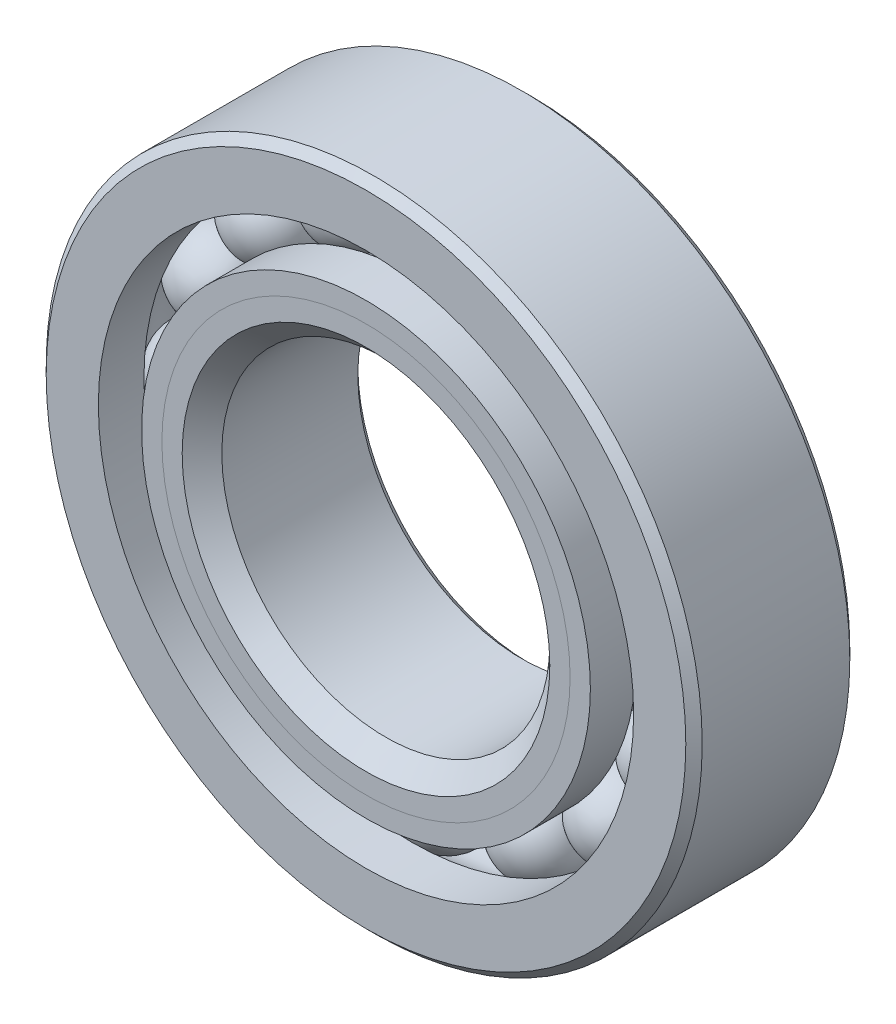
ISO-10303-21;
HEADER;
FILE_DESCRIPTION(('STEP AP214'),'2;1');
FILE_NAME('part.step','',(''),(''),'','','');
FILE_SCHEMA(('AUTOMOTIVE_DESIGN { 1 0 10303 214 1 1 1 1 }'));
ENDSEC;
DATA;
#1=APPLICATION_CONTEXT('core data for automotive mechanical design processes');
#2=APPLICATION_PROTOCOL_DEFINITION('international standard','automotive_design',2000,#1);
#3=PRODUCT_CONTEXT('',#1,'mechanical');
#4=PRODUCT('Part','Part','',(#3));
#5=PRODUCT_RELATED_PRODUCT_CATEGORY('part','',(#4));
#6=PRODUCT_DEFINITION_FORMATION('','',#4);
#7=PRODUCT_DEFINITION_CONTEXT('part definition',#1,'design');
#8=PRODUCT_DEFINITION('design','',#6,#7);
#9=PRODUCT_DEFINITION_SHAPE('','',#8);
#10=(LENGTH_UNIT() NAMED_UNIT(*) SI_UNIT(.MILLI.,.METRE.));
#11=(NAMED_UNIT(*) PLANE_ANGLE_UNIT() SI_UNIT($,.RADIAN.));
#12=(NAMED_UNIT(*) SI_UNIT($,.STERADIAN.) SOLID_ANGLE_UNIT());
#13=UNCERTAINTY_MEASURE_WITH_UNIT(LENGTH_MEASURE(1.E-05),#10,'distance_accuracy_value','');
#14=(GEOMETRIC_REPRESENTATION_CONTEXT(3) GLOBAL_UNCERTAINTY_ASSIGNED_CONTEXT((#13)) GLOBAL_UNIT_ASSIGNED_CONTEXT((#10,
#11,#12)) REPRESENTATION_CONTEXT('',''));
#15=CARTESIAN_POINT('',(0.,0.,0.));
#16=DIRECTION('',(0.,0.,1.));
#17=DIRECTION('',(1.,0.,0.));
#18=AXIS2_PLACEMENT_3D('',#15,#16,#17);
#19=CARTESIAN_POINT('',(-1.82252984663868,4.39997627358503,0.));
#20=DIRECTION('',(0.,0.,1.));
#21=DIRECTION('',(-0.382683432365077,0.923879532511292,0.));
#22=AXIS2_PLACEMENT_3D('',#19,#20,#21);
#23=SPHERICAL_SURFACE('',#22,0.820428356767388);
#24=CARTESIAN_POINT('',(-1.82252984663868,4.39997627358503,0.820428356767387));
#25=VERTEX_POINT('',#24);
#26=VERTEX_LOOP('',#25);
#27=FACE_BOUND('',#26,.T.);
#28=ADVANCED_FACE('F37',(#27),#23,.T.);
#29=CLOSED_SHELL('',(#28));
#30=MANIFOLD_SOLID_BREP('B2',#29);
#31=CARTESIAN_POINT('',(-3.36759604540089,3.36759604540097,0.));
#32=DIRECTION('',(0.,0.,1.));
#33=DIRECTION('',(-0.707106781186539,0.707106781186556,0.));
#34=AXIS2_PLACEMENT_3D('',#31,#32,#33);
#35=SPHERICAL_SURFACE('',#34,0.820428356767388);
#36=CARTESIAN_POINT('',(-3.36759604540089,3.36759604540097,0.820428356767387));
#37=VERTEX_POINT('',#36);
#38=VERTEX_LOOP('',#37);
#39=FACE_BOUND('',#38,.T.);
#40=ADVANCED_FACE('F57',(#39),#35,.T.);
#41=CLOSED_SHELL('',(#40));
#42=MANIFOLD_SOLID_BREP('B6',#41);
#43=CARTESIAN_POINT('',(-4.39997627358498,1.82252984663879,0.));
#44=DIRECTION('',(0.,0.,1.));
#45=DIRECTION('',(-0.923879532511283,0.3826834323651,0.));
#46=AXIS2_PLACEMENT_3D('',#43,#44,#45);
#47=SPHERICAL_SURFACE('',#46,0.820428356767388);
#48=CARTESIAN_POINT('',(-4.39997627358498,1.82252984663879,0.820428356767387));
#49=VERTEX_POINT('',#48);
#50=VERTEX_LOOP('',#49);
#51=FACE_BOUND('',#50,.T.);
#52=ADVANCED_FACE('F77',(#51),#47,.T.);
#53=CLOSED_SHELL('',(#52));
#54=MANIFOLD_SOLID_BREP('B33',#53);
#55=CARTESIAN_POINT('',(-4.7625,0.,0.));
#56=DIRECTION('',(0.,0.,1.));
#57=DIRECTION('',(-1.,0.,0.));
#58=AXIS2_PLACEMENT_3D('',#55,#56,#57);
#59=SPHERICAL_SURFACE('',#58,0.820428356767388);
#60=CARTESIAN_POINT('',(-4.7625,0.,0.820428356767387));
#61=VERTEX_POINT('',#60);
#62=VERTEX_LOOP('',#61);
#63=FACE_BOUND('',#62,.T.);
#64=ADVANCED_FACE('F97',(#63),#59,.T.);
#65=CLOSED_SHELL('',(#64));
#66=MANIFOLD_SOLID_BREP('B53',#65);
#67=CARTESIAN_POINT('',(-4.39997627358502,-1.8225298466387,0.));
#68=DIRECTION('',(0.,0.,1.));
#69=DIRECTION('',(-0.923879532511291,-0.382683432365081,0.));
#70=AXIS2_PLACEMENT_3D('',#67,#68,#69);
#71=SPHERICAL_SURFACE('',#70,0.820428356767388);
#72=CARTESIAN_POINT('',(-4.39997627358502,-1.8225298466387,0.820428356767387));
#73=VERTEX_POINT('',#72);
#74=VERTEX_LOOP('',#73);
#75=FACE_BOUND('',#74,.T.);
#76=ADVANCED_FACE('F117',(#75),#71,.T.);
#77=CLOSED_SHELL('',(#76));
#78=MANIFOLD_SOLID_BREP('B73',#77);
#79=CARTESIAN_POINT('',(-3.36759604540096,-3.3675960454009,0.));
#80=DIRECTION('',(0.,0.,1.));
#81=DIRECTION('',(-0.707106781186554,-0.707106781186541,0.));
#82=AXIS2_PLACEMENT_3D('',#79,#80,#81);
#83=SPHERICAL_SURFACE('',#82,0.820428356767388);
#84=CARTESIAN_POINT('',(-3.36759604540096,-3.3675960454009,0.820428356767387));
#85=VERTEX_POINT('',#84);
#86=VERTEX_LOOP('',#85);
#87=FACE_BOUND('',#86,.T.);
#88=ADVANCED_FACE('F148',(#87),#83,.T.);
#89=CLOSED_SHELL('',(#88));
#90=MANIFOLD_SOLID_BREP('B93',#89);
#91=CARTESIAN_POINT('',(-1.82252984663877,-4.39997627358499,0.));
#92=DIRECTION('',(0.,0.,1.));
#93=DIRECTION('',(-0.382683432365097,-0.923879532511284,0.));
#94=AXIS2_PLACEMENT_3D('',#91,#92,#93);
#95=SPHERICAL_SURFACE('',#94,0.820428356767388);
#96=CARTESIAN_POINT('',(-1.82252984663877,-4.39997627358499,0.820428356767387));
#97=VERTEX_POINT('',#96);
#98=VERTEX_LOOP('',#97);
#99=FACE_BOUND('',#98,.T.);
#100=ADVANCED_FACE('F179',(#99),#95,.T.);
#101=CLOSED_SHELL('',(#100));
#102=MANIFOLD_SOLID_BREP('B113',#101);
#103=CARTESIAN_POINT('',(0.,-4.7625,0.));
#104=DIRECTION('',(0.,0.,1.));
#105=DIRECTION('',(0.,-1.,0.));
#106=AXIS2_PLACEMENT_3D('',#103,#104,#105);
#107=SPHERICAL_SURFACE('',#106,0.820428356767388);
#108=CARTESIAN_POINT('',(0.,-4.7625,0.820428356767387));
#109=VERTEX_POINT('',#108);
#110=VERTEX_LOOP('',#109);
#111=FACE_BOUND('',#110,.T.);
#112=ADVANCED_FACE('F210',(#111),#107,.T.);
#113=CLOSED_SHELL('',(#112));
#114=MANIFOLD_SOLID_BREP('B144',#113);
#115=CARTESIAN_POINT('',(1.82252984663871,-4.39997627358501,0.));
#116=DIRECTION('',(0.,0.,1.));
#117=DIRECTION('',(0.382683432365084,-0.923879532511289,0.));
#118=AXIS2_PLACEMENT_3D('',#115,#116,#117);
#119=SPHERICAL_SURFACE('',#118,0.820428356767388);
#120=CARTESIAN_POINT('',(1.82252984663871,-4.39997627358501,0.820428356767387));
#121=VERTEX_POINT('',#120);
#122=VERTEX_LOOP('',#121);
#123=FACE_BOUND('',#122,.T.);
#124=ADVANCED_FACE('F239',(#123),#119,.T.);
#125=CLOSED_SHELL('',(#124));
#126=MANIFOLD_SOLID_BREP('B175',#125);
#127=CARTESIAN_POINT('',(3.36759604540091,-3.36759604540095,0.));
#128=DIRECTION('',(0.,0.,1.));
#129=DIRECTION('',(0.707106781186544,-0.707106781186551,0.));
#130=AXIS2_PLACEMENT_3D('',#127,#128,#129);
#131=SPHERICAL_SURFACE('',#130,0.820428356767388);
#132=CARTESIAN_POINT('',(3.36759604540091,-3.36759604540095,0.820428356767387));
#133=VERTEX_POINT('',#132);
#134=VERTEX_LOOP('',#133);
#135=FACE_BOUND('',#134,.T.);
#136=ADVANCED_FACE('F270',(#135),#131,.T.);
#137=CLOSED_SHELL('',(#136));
#138=MANIFOLD_SOLID_BREP('B206',#137);
#139=CARTESIAN_POINT('',(4.399976273585,-1.82252984663876,0.));
#140=DIRECTION('',(0.,0.,1.));
#141=DIRECTION('',(0.923879532511285,-0.382683432365094,0.));
#142=AXIS2_PLACEMENT_3D('',#139,#140,#141);
#143=SPHERICAL_SURFACE('',#142,0.820428356767388);
#144=CARTESIAN_POINT('',(4.399976273585,-1.82252984663876,0.820428356767387));
#145=VERTEX_POINT('',#144);
#146=VERTEX_LOOP('',#145);
#147=FACE_BOUND('',#146,.T.);
#148=ADVANCED_FACE('F299',(#147),#143,.T.);
#149=CLOSED_SHELL('',(#148));
#150=MANIFOLD_SOLID_BREP('B235',#149);
#151=CARTESIAN_POINT('',(4.7625,0.,0.));
#152=DIRECTION('',(0.,0.,1.));
#153=DIRECTION('',(1.,0.,0.));
#154=AXIS2_PLACEMENT_3D('',#151,#152,#153);
#155=SPHERICAL_SURFACE('',#154,0.820428356767388);
#156=CARTESIAN_POINT('',(4.7625,0.,0.820428356767387));
#157=VERTEX_POINT('',#156);
#158=VERTEX_LOOP('',#157);
#159=FACE_BOUND('',#158,.T.);
#160=ADVANCED_FACE('F330',(#159),#155,.T.);
#161=CLOSED_SHELL('',(#160));
#162=MANIFOLD_SOLID_BREP('B266',#161);
#163=CARTESIAN_POINT('',(4.39997627358501,1.82252984663873,0.));
#164=DIRECTION('',(0.,0.,1.));
#165=DIRECTION('',(0.923879532511288,0.382683432365087,0.));
#166=AXIS2_PLACEMENT_3D('',#163,#164,#165);
#167=SPHERICAL_SURFACE('',#166,0.820428356767388);
#168=CARTESIAN_POINT('',(4.39997627358501,1.82252984663873,0.820428356767387));
#169=VERTEX_POINT('',#168);
#170=VERTEX_LOOP('',#169);
#171=FACE_BOUND('',#170,.T.);
#172=ADVANCED_FACE('F361',(#171),#167,.T.);
#173=CLOSED_SHELL('',(#172));
#174=MANIFOLD_SOLID_BREP('B295',#173);
#175=CARTESIAN_POINT('',(3.36759604540094,3.36759604540093,0.));
#176=DIRECTION('',(0.,0.,1.));
#177=DIRECTION('',(0.707106781186549,0.707106781186546,0.));
#178=AXIS2_PLACEMENT_3D('',#175,#176,#177);
#179=SPHERICAL_SURFACE('',#178,0.820428356767388);
#180=CARTESIAN_POINT('',(3.36759604540094,3.36759604540093,0.820428356767387));
#181=VERTEX_POINT('',#180);
#182=VERTEX_LOOP('',#181);
#183=FACE_BOUND('',#182,.T.);
#184=ADVANCED_FACE('F392',(#183),#179,.T.);
#185=CLOSED_SHELL('',(#184));
#186=MANIFOLD_SOLID_BREP('B326',#185);
#187=CARTESIAN_POINT('',(1.82252984663874,4.399976273585,0.));
#188=DIRECTION('',(0.,0.,1.));
#189=DIRECTION('',(0.382683432365091,0.923879532511287,0.));
#190=AXIS2_PLACEMENT_3D('',#187,#188,#189);
#191=SPHERICAL_SURFACE('',#190,0.820428356767388);
#192=CARTESIAN_POINT('',(1.82252984663874,4.399976273585,0.820428356767387));
#193=VERTEX_POINT('',#192);
#194=VERTEX_LOOP('',#193);
#195=FACE_BOUND('',#194,.T.);
#196=ADVANCED_FACE('F421',(#195),#191,.T.);
#197=CLOSED_SHELL('',(#196));
#198=MANIFOLD_SOLID_BREP('B357',#197);
#199=CARTESIAN_POINT('',(0.,4.7625,0.));
#200=DIRECTION('',(0.,0.,1.));
#201=DIRECTION('',(0.,1.,0.));
#202=AXIS2_PLACEMENT_3D('',#199,#200,#201);
#203=SPHERICAL_SURFACE('',#202,0.820428356767388);
#204=CARTESIAN_POINT('',(0.,4.7625,0.820428356767387));
#205=VERTEX_POINT('',#204);
#206=VERTEX_LOOP('',#205);
#207=FACE_BOUND('',#206,.T.);
#208=ADVANCED_FACE('F452',(#207),#203,.T.);
#209=CLOSED_SHELL('',(#208));
#210=MANIFOLD_SOLID_BREP('B388',#209);
#211=CARTESIAN_POINT('',(0.,3.95117725146749,1.5875));
#212=DIRECTION('',(0.,0.,-1.));
#213=DIRECTION('',(-1.,0.,0.));
#214=AXIS2_PLACEMENT_3D('',#211,#212,#213);
#215=PLANE('',#214);
#216=CARTESIAN_POINT('',(0.,0.,1.5875));
#217=DIRECTION('',(0.,0.,1.));
#218=DIRECTION('',(1.,0.,0.));
#219=AXIS2_PLACEMENT_3D('',#216,#217,#218);
#220=CIRCLE('',#219,3.55853582161631);
#221=CARTESIAN_POINT('',(3.55853582161631,0.,1.5875));
#222=VERTEX_POINT('',#221);
#223=EDGE_CURVE('E506',#222,#222,#220,.T.);
#224=ORIENTED_EDGE('',*,*,#223,.F.);
#225=EDGE_LOOP('',(#224));
#226=FACE_BOUND('',#225,.T.);
#227=CARTESIAN_POINT('',(0.,0.,1.5875));
#228=DIRECTION('',(0.,0.,1.));
#229=DIRECTION('',(1.,0.,0.));
#230=AXIS2_PLACEMENT_3D('',#227,#228,#229);
#231=CIRCLE('',#230,3.95117725146749);
#232=CARTESIAN_POINT('',(3.95117725146749,0.,1.5875));
#233=VERTEX_POINT('',#232);
#234=EDGE_CURVE('E451',#233,#233,#231,.T.);
#235=ORIENTED_EDGE('',*,*,#234,.T.);
#236=EDGE_LOOP('',(#235));
#237=FACE_BOUND('',#236,.T.);
#238=ADVANCED_FACE('F472',(#226,#237),#215,.F.);
#239=CARTESIAN_POINT('',(0.,0.,1.19485857014881));
#240=DIRECTION('',(0.,0.,1.));
#241=DIRECTION('',(1.,0.,0.));
#242=AXIS2_PLACEMENT_3D('',#239,#240,#241);
#243=CONICAL_SURFACE('',#242,3.55853582161631,0.78539816339745);
#244=ORIENTED_EDGE('',*,*,#234,.F.);
#245=EDGE_LOOP('',(#244));
#246=FACE_BOUND('',#245,.T.);
#247=CARTESIAN_POINT('',(0.,0.,1.19485857014881));
#248=DIRECTION('',(0.,0.,1.));
#249=DIRECTION('',(1.,0.,0.));
#250=AXIS2_PLACEMENT_3D('',#247,#248,#249);
#251=CIRCLE('',#250,3.55853582161631);
#252=CARTESIAN_POINT('',(3.55853582161631,0.,1.19485857014881));
#253=VERTEX_POINT('',#252);
#254=EDGE_CURVE('E478',#253,#253,#251,.T.);
#255=ORIENTED_EDGE('',*,*,#254,.T.);
#256=EDGE_LOOP('',(#255));
#257=FACE_BOUND('',#256,.T.);
#258=ADVANCED_FACE('F513',(#246,#257),#243,.T.);
#259=CARTESIAN_POINT('',(0.,0.,1.5875));
#260=DIRECTION('',(0.,0.,1.));
#261=DIRECTION('',(1.,0.,0.));
#262=AXIS2_PLACEMENT_3D('',#259,#260,#261);
#263=CYLINDRICAL_SURFACE('',#262,3.55853582161631);
#264=ORIENTED_EDGE('',*,*,#254,.F.);
#265=EDGE_LOOP('',(#264));
#266=FACE_BOUND('',#265,.T.);
#267=CARTESIAN_POINT('',(0.,0.,0.));
#268=DIRECTION('',(0.,0.,1.));
#269=DIRECTION('',(1.,0.,0.));
#270=AXIS2_PLACEMENT_3D('',#267,#268,#269);
#271=CIRCLE('',#270,3.55853582161631);
#272=CARTESIAN_POINT('',(3.55853582161631,0.,0.));
#273=VERTEX_POINT('',#272);
#274=EDGE_CURVE('E482',#273,#273,#271,.T.);
#275=ORIENTED_EDGE('',*,*,#274,.T.);
#276=EDGE_LOOP('',(#275));
#277=FACE_BOUND('',#276,.T.);
#278=ADVANCED_FACE('F517',(#266,#277),#263,.T.);
#279=CARTESIAN_POINT('',(0.,3.55853582161631,0.));
#280=DIRECTION('',(0.,0.,-1.));
#281=DIRECTION('',(-1.,0.,0.));
#282=AXIS2_PLACEMENT_3D('',#279,#280,#281);
#283=PLANE('',#282);
#284=ORIENTED_EDGE('',*,*,#274,.F.);
#285=EDGE_LOOP('',(#284));
#286=FACE_BOUND('',#285,.T.);
#287=CARTESIAN_POINT('',(0.,0.,0.));
#288=DIRECTION('',(0.,0.,1.));
#289=DIRECTION('',(1.,0.,0.));
#290=AXIS2_PLACEMENT_3D('',#287,#288,#289);
#291=CIRCLE('',#290,3.94207164323261);
#292=CARTESIAN_POINT('',(3.94207164323261,0.,0.));
#293=VERTEX_POINT('',#292);
#294=EDGE_CURVE('E486',#293,#293,#291,.T.);
#295=ORIENTED_EDGE('',*,*,#294,.T.);
#296=EDGE_LOOP('',(#295));
#297=FACE_BOUND('',#296,.T.);
#298=ADVANCED_FACE('F522',(#286,#297),#283,.F.);
#299=CARTESIAN_POINT('',(0.,0.,0.));
#300=DIRECTION('',(0.,0.,1.));
#301=DIRECTION('',(1.,0.,0.));
#302=AXIS2_PLACEMENT_3D('',#299,#300,#301);
#303=TOROIDAL_SURFACE('',#302,4.7625,0.820428356767388);
#304=ORIENTED_EDGE('',*,*,#294,.F.);
#305=EDGE_LOOP('',(#304));
#306=FACE_BOUND('',#305,.T.);
#307=CARTESIAN_POINT('',(0.,0.,-0.705555555555556));
#308=DIRECTION('',(0.,0.,1.));
#309=DIRECTION('',(1.,0.,0.));
#310=AXIS2_PLACEMENT_3D('',#307,#308,#309);
#311=CIRCLE('',#310,4.34381868131868);
#312=CARTESIAN_POINT('',(4.34381868131868,0.,-0.705555555555556));
#313=VERTEX_POINT('',#312);
#314=EDGE_CURVE('E491',#313,#313,#311,.T.);
#315=ORIENTED_EDGE('',*,*,#314,.T.);
#316=EDGE_LOOP('',(#315));
#317=FACE_BOUND('',#316,.T.);
#318=ADVANCED_FACE('F528',(#306,#317),#303,.F.);
#319=CARTESIAN_POINT('',(0.,0.,1.5875));
#320=DIRECTION('',(0.,0.,1.));
#321=DIRECTION('',(1.,0.,0.));
#322=AXIS2_PLACEMENT_3D('',#319,#320,#321);
#323=CYLINDRICAL_SURFACE('',#322,4.34381868131868);
#324=ORIENTED_EDGE('',*,*,#314,.F.);
#325=EDGE_LOOP('',(#324));
#326=FACE_BOUND('',#325,.T.);
#327=CARTESIAN_POINT('',(0.,0.,-1.5875));
#328=DIRECTION('',(0.,0.,1.));
#329=DIRECTION('',(1.,0.,0.));
#330=AXIS2_PLACEMENT_3D('',#327,#328,#329);
#331=CIRCLE('',#330,4.34381868131868);
#332=CARTESIAN_POINT('',(4.34381868131868,0.,-1.5875));
#333=VERTEX_POINT('',#332);
#334=EDGE_CURVE('E494',#333,#333,#331,.T.);
#335=ORIENTED_EDGE('',*,*,#334,.T.);
#336=EDGE_LOOP('',(#335));
#337=FACE_BOUND('',#336,.T.);
#338=ADVANCED_FACE('F532',(#326,#337),#323,.T.);
#339=CARTESIAN_POINT('',(0.,3.33375,-1.5875));
#340=DIRECTION('',(0.,0.,1.));
#341=DIRECTION('',(1.,0.,0.));
#342=AXIS2_PLACEMENT_3D('',#339,#340,#341);
#343=PLANE('',#342);
#344=ORIENTED_EDGE('',*,*,#334,.F.);
#345=EDGE_LOOP('',(#344));
#346=FACE_BOUND('',#345,.T.);
#347=CARTESIAN_POINT('',(0.,0.,-1.5875));
#348=DIRECTION('',(0.,0.,1.));
#349=DIRECTION('',(1.,0.,0.));
#350=AXIS2_PLACEMENT_3D('',#347,#348,#349);
#351=CIRCLE('',#350,3.33375);
#352=CARTESIAN_POINT('',(3.33375,0.,-1.5875));
#353=VERTEX_POINT('',#352);
#354=EDGE_CURVE('E497',#353,#353,#351,.T.);
#355=ORIENTED_EDGE('',*,*,#354,.T.);
#356=EDGE_LOOP('',(#355));
#357=FACE_BOUND('',#356,.T.);
#358=ADVANCED_FACE('F536',(#346,#357),#343,.F.);
#359=CARTESIAN_POINT('',(0.,0.,-1.42875));
#360=DIRECTION('',(0.,0.,-1.));
#361=DIRECTION('',(-1.,0.,0.));
#362=AXIS2_PLACEMENT_3D('',#359,#360,#361);
#363=CONICAL_SURFACE('',#362,3.175,0.785398163397448);
#364=ORIENTED_EDGE('',*,*,#354,.F.);
#365=EDGE_LOOP('',(#364));
#366=FACE_BOUND('',#365,.T.);
#367=CARTESIAN_POINT('',(0.,0.,-1.42875));
#368=DIRECTION('',(0.,0.,1.));
#369=DIRECTION('',(1.,0.,0.));
#370=AXIS2_PLACEMENT_3D('',#367,#368,#369);
#371=CIRCLE('',#370,3.175);
#372=CARTESIAN_POINT('',(3.175,0.,-1.42875));
#373=VERTEX_POINT('',#372);
#374=EDGE_CURVE('E500',#373,#373,#371,.T.);
#375=ORIENTED_EDGE('',*,*,#374,.T.);
#376=EDGE_LOOP('',(#375));
#377=FACE_BOUND('',#376,.T.);
#378=ADVANCED_FACE('F540',(#366,#377),#363,.F.);
#379=CARTESIAN_POINT('',(0.,0.,1.5875));
#380=DIRECTION('',(0.,0.,1.));
#381=DIRECTION('',(1.,0.,0.));
#382=AXIS2_PLACEMENT_3D('',#379,#380,#381);
#383=CYLINDRICAL_SURFACE('',#382,3.175);
#384=ORIENTED_EDGE('',*,*,#374,.F.);
#385=EDGE_LOOP('',(#384));
#386=FACE_BOUND('',#385,.T.);
#387=CARTESIAN_POINT('',(0.,0.,1.2039641783837));
#388=DIRECTION('',(0.,0.,1.));
#389=DIRECTION('',(1.,0.,0.));
#390=AXIS2_PLACEMENT_3D('',#387,#388,#389);
#391=CIRCLE('',#390,3.175);
#392=CARTESIAN_POINT('',(3.175,0.,1.2039641783837));
#393=VERTEX_POINT('',#392);
#394=EDGE_CURVE('E503',#393,#393,#391,.T.);
#395=ORIENTED_EDGE('',*,*,#394,.T.);
#396=EDGE_LOOP('',(#395));
#397=FACE_BOUND('',#396,.T.);
#398=ADVANCED_FACE('F544',(#386,#397),#383,.F.);
#399=CARTESIAN_POINT('',(0.,0.,1.5875));
#400=DIRECTION('',(0.,0.,1.));
#401=DIRECTION('',(1.,0.,0.));
#402=AXIS2_PLACEMENT_3D('',#399,#400,#401);
#403=CONICAL_SURFACE('',#402,3.55853582161631,0.78539816339745);
#404=ORIENTED_EDGE('',*,*,#394,.F.);
#405=EDGE_LOOP('',(#404));
#406=FACE_BOUND('',#405,.T.);
#407=ORIENTED_EDGE('',*,*,#223,.T.);
#408=EDGE_LOOP('',(#407));
#409=FACE_BOUND('',#408,.T.);
#410=ADVANCED_FACE('F510',(#406,#409),#403,.F.);
#411=CLOSED_SHELL('',(#238,#258,#278,#298,#318,#338,#358,#378,#398,#410));
#412=MANIFOLD_SOLID_BREP('B417',#411);
#413=CARTESIAN_POINT('',(0.,4.34381868131868,1.5875));
#414=DIRECTION('',(0.,0.,-1.));
#415=DIRECTION('',(-1.,0.,0.));
#416=AXIS2_PLACEMENT_3D('',#413,#414,#415);
#417=PLANE('',#416);
#418=CARTESIAN_POINT('',(0.,0.,1.5875));
#419=DIRECTION('',(0.,0.,1.));
#420=DIRECTION('',(1.,0.,0.));
#421=AXIS2_PLACEMENT_3D('',#418,#419,#420);
#422=CIRCLE('',#421,3.95117725146749);
#423=CARTESIAN_POINT('',(3.95117725146749,0.,1.5875));
#424=VERTEX_POINT('',#423);
#425=EDGE_CURVE('E471',#424,#424,#422,.T.);
#426=ORIENTED_EDGE('',*,*,#425,.F.);
#427=EDGE_LOOP('',(#426));
#428=FACE_BOUND('',#427,.T.);
#429=CARTESIAN_POINT('',(0.,0.,1.5875));
#430=DIRECTION('',(0.,0.,1.));
#431=DIRECTION('',(1.,0.,0.));
#432=AXIS2_PLACEMENT_3D('',#429,#430,#431);
#433=CIRCLE('',#432,4.34381868131868);
#434=CARTESIAN_POINT('',(4.34381868131868,0.,1.5875));
#435=VERTEX_POINT('',#434);
#436=EDGE_CURVE('E652',#435,#435,#433,.T.);
#437=ORIENTED_EDGE('',*,*,#436,.T.);
#438=EDGE_LOOP('',(#437));
#439=FACE_BOUND('',#438,.T.);
#440=ADVANCED_FACE('F630',(#428,#439),#417,.F.);
#441=CARTESIAN_POINT('',(0.,0.,1.5875));
#442=DIRECTION('',(0.,0.,1.));
#443=DIRECTION('',(1.,0.,0.));
#444=AXIS2_PLACEMENT_3D('',#441,#442,#443);
#445=CONICAL_SURFACE('',#444,3.95117725146749,0.78539816339745);
#446=CARTESIAN_POINT('',(0.,0.,1.19485857014881));
#447=DIRECTION('',(0.,0.,1.));
#448=DIRECTION('',(1.,0.,0.));
#449=AXIS2_PLACEMENT_3D('',#446,#447,#448);
#450=CIRCLE('',#449,3.55853582161631);
#451=CARTESIAN_POINT('',(3.55853582161631,0.,1.19485857014881));
#452=VERTEX_POINT('',#451);
#453=EDGE_CURVE('E636',#452,#452,#450,.T.);
#454=ORIENTED_EDGE('',*,*,#453,.F.);
#455=EDGE_LOOP('',(#454));
#456=FACE_BOUND('',#455,.T.);
#457=ORIENTED_EDGE('',*,*,#425,.T.);
#458=EDGE_LOOP('',(#457));
#459=FACE_BOUND('',#458,.T.);
#460=ADVANCED_FACE('F677',(#456,#459),#445,.F.);
#461=CARTESIAN_POINT('',(0.,0.,1.5875));
#462=DIRECTION('',(0.,0.,1.));
#463=DIRECTION('',(1.,0.,0.));
#464=AXIS2_PLACEMENT_3D('',#461,#462,#463);
#465=CYLINDRICAL_SURFACE('',#464,3.55853582161631);
#466=CARTESIAN_POINT('',(0.,0.,0.));
#467=DIRECTION('',(0.,0.,1.));
#468=DIRECTION('',(1.,0.,0.));
#469=AXIS2_PLACEMENT_3D('',#466,#467,#468);
#470=CIRCLE('',#469,3.55853582161631);
#471=CARTESIAN_POINT('',(3.55853582161631,0.,0.));
#472=VERTEX_POINT('',#471);
#473=EDGE_CURVE('E640',#472,#472,#470,.T.);
#474=ORIENTED_EDGE('',*,*,#473,.F.);
#475=EDGE_LOOP('',(#474));
#476=FACE_BOUND('',#475,.T.);
#477=ORIENTED_EDGE('',*,*,#453,.T.);
#478=EDGE_LOOP('',(#477));
#479=FACE_BOUND('',#478,.T.);
#480=ADVANCED_FACE('F672',(#476,#479),#465,.F.);
#481=CARTESIAN_POINT('',(0.,3.55853582161631,0.));
#482=DIRECTION('',(0.,0.,1.));
#483=DIRECTION('',(1.,0.,0.));
#484=AXIS2_PLACEMENT_3D('',#481,#482,#483);
#485=PLANE('',#484);
#486=CARTESIAN_POINT('',(0.,0.,0.));
#487=DIRECTION('',(0.,0.,1.));
#488=DIRECTION('',(1.,0.,0.));
#489=AXIS2_PLACEMENT_3D('',#486,#487,#488);
#490=CIRCLE('',#489,3.94207164323261);
#491=CARTESIAN_POINT('',(3.94207164323261,0.,0.));
#492=VERTEX_POINT('',#491);
#493=EDGE_CURVE('E644',#492,#492,#490,.T.);
#494=ORIENTED_EDGE('',*,*,#493,.F.);
#495=EDGE_LOOP('',(#494));
#496=FACE_BOUND('',#495,.T.);
#497=ORIENTED_EDGE('',*,*,#473,.T.);
#498=EDGE_LOOP('',(#497));
#499=FACE_BOUND('',#498,.T.);
#500=ADVANCED_FACE('F666',(#496,#499),#485,.F.);
#501=CARTESIAN_POINT('',(0.,0.,0.));
#502=DIRECTION('',(0.,0.,1.));
#503=DIRECTION('',(1.,0.,0.));
#504=AXIS2_PLACEMENT_3D('',#501,#502,#503);
#505=TOROIDAL_SURFACE('',#504,4.7625,0.820428356767388);
#506=CARTESIAN_POINT('',(0.,0.,0.705555555555555));
#507=DIRECTION('',(0.,0.,1.));
#508=DIRECTION('',(1.,0.,0.));
#509=AXIS2_PLACEMENT_3D('',#506,#507,#508);
#510=CIRCLE('',#509,4.34381868131868);
#511=CARTESIAN_POINT('',(4.34381868131868,0.,0.705555555555555));
#512=VERTEX_POINT('',#511);
#513=EDGE_CURVE('E649',#512,#512,#510,.T.);
#514=ORIENTED_EDGE('',*,*,#513,.F.);
#515=EDGE_LOOP('',(#514));
#516=FACE_BOUND('',#515,.T.);
#517=ORIENTED_EDGE('',*,*,#493,.T.);
#518=EDGE_LOOP('',(#517));
#519=FACE_BOUND('',#518,.T.);
#520=ADVANCED_FACE('F660',(#516,#519),#505,.F.);
#521=CARTESIAN_POINT('',(0.,0.,1.5875));
#522=DIRECTION('',(0.,0.,1.));
#523=DIRECTION('',(1.,0.,0.));
#524=AXIS2_PLACEMENT_3D('',#521,#522,#523);
#525=CYLINDRICAL_SURFACE('',#524,4.34381868131868);
#526=ORIENTED_EDGE('',*,*,#436,.F.);
#527=EDGE_LOOP('',(#526));
#528=FACE_BOUND('',#527,.T.);
#529=ORIENTED_EDGE('',*,*,#513,.T.);
#530=EDGE_LOOP('',(#529));
#531=FACE_BOUND('',#530,.T.);
#532=ADVANCED_FACE('F657',(#528,#531),#525,.T.);
#533=CLOSED_SHELL('',(#440,#460,#480,#500,#520,#532));
#534=MANIFOLD_SOLID_BREP('B446',#533);
#535=CARTESIAN_POINT('',(0.,0.,1.42875));
#536=DIRECTION('',(0.,0.,-1.));
#537=DIRECTION('',(-1.,0.,0.));
#538=AXIS2_PLACEMENT_3D('',#535,#536,#537);
#539=CONICAL_SURFACE('',#538,6.35,0.785398163397448);
#540=CARTESIAN_POINT('',(0.,0.,1.5875));
#541=DIRECTION('',(0.,0.,1.));
#542=DIRECTION('',(1.,0.,0.));
#543=AXIS2_PLACEMENT_3D('',#540,#541,#542);
#544=CIRCLE('',#543,6.19125);
#545=CARTESIAN_POINT('',(6.19125,0.,1.5875));
#546=VERTEX_POINT('',#545);
#547=EDGE_CURVE('E749',#546,#546,#544,.T.);
#548=ORIENTED_EDGE('',*,*,#547,.F.);
#549=EDGE_LOOP('',(#548));
#550=FACE_BOUND('',#549,.T.);
#551=CARTESIAN_POINT('',(0.,0.,1.42875));
#552=DIRECTION('',(0.,0.,1.));
#553=DIRECTION('',(1.,0.,0.));
#554=AXIS2_PLACEMENT_3D('',#551,#552,#553);
#555=CIRCLE('',#554,6.35);
#556=CARTESIAN_POINT('',(6.35,0.,1.42875));
#557=VERTEX_POINT('',#556);
#558=EDGE_CURVE('E629',#557,#557,#555,.T.);
#559=ORIENTED_EDGE('',*,*,#558,.T.);
#560=EDGE_LOOP('',(#559));
#561=FACE_BOUND('',#560,.T.);
#562=ADVANCED_FACE('F721',(#550,#561),#539,.T.);
#563=CARTESIAN_POINT('',(0.,0.,1.5875));
#564=DIRECTION('',(0.,0.,1.));
#565=DIRECTION('',(1.,0.,0.));
#566=AXIS2_PLACEMENT_3D('',#563,#564,#565);
#567=CYLINDRICAL_SURFACE('',#566,6.35);
#568=ORIENTED_EDGE('',*,*,#558,.F.);
#569=EDGE_LOOP('',(#568));
#570=FACE_BOUND('',#569,.T.);
#571=CARTESIAN_POINT('',(0.,0.,-1.42875));
#572=DIRECTION('',(0.,0.,1.));
#573=DIRECTION('',(1.,0.,0.));
#574=AXIS2_PLACEMENT_3D('',#571,#572,#573);
#575=CIRCLE('',#574,6.35);
#576=CARTESIAN_POINT('',(6.35,0.,-1.42875));
#577=VERTEX_POINT('',#576);
#578=EDGE_CURVE('E727',#577,#577,#575,.T.);
#579=ORIENTED_EDGE('',*,*,#578,.T.);
#580=EDGE_LOOP('',(#579));
#581=FACE_BOUND('',#580,.T.);
#582=ADVANCED_FACE('F756',(#570,#581),#567,.T.);
#583=CARTESIAN_POINT('',(0.,0.,-1.5875));
#584=DIRECTION('',(0.,0.,1.));
#585=DIRECTION('',(1.,0.,0.));
#586=AXIS2_PLACEMENT_3D('',#583,#584,#585);
#587=CONICAL_SURFACE('',#586,6.19125,0.785398163397448);
#588=ORIENTED_EDGE('',*,*,#578,.F.);
#589=EDGE_LOOP('',(#588));
#590=FACE_BOUND('',#589,.T.);
#591=CARTESIAN_POINT('',(0.,0.,-1.5875));
#592=DIRECTION('',(0.,0.,1.));
#593=DIRECTION('',(1.,0.,0.));
#594=AXIS2_PLACEMENT_3D('',#591,#592,#593);
#595=CIRCLE('',#594,6.19125);
#596=CARTESIAN_POINT('',(6.19125,0.,-1.5875));
#597=VERTEX_POINT('',#596);
#598=EDGE_CURVE('E731',#597,#597,#595,.T.);
#599=ORIENTED_EDGE('',*,*,#598,.T.);
#600=EDGE_LOOP('',(#599));
#601=FACE_BOUND('',#600,.T.);
#602=ADVANCED_FACE('F760',(#590,#601),#587,.T.);
#603=CARTESIAN_POINT('',(0.,6.19125,-1.5875));
#604=DIRECTION('',(0.,0.,1.));
#605=DIRECTION('',(1.,0.,0.));
#606=AXIS2_PLACEMENT_3D('',#603,#604,#605);
#607=PLANE('',#606);
#608=ORIENTED_EDGE('',*,*,#598,.F.);
#609=EDGE_LOOP('',(#608));
#610=FACE_BOUND('',#609,.T.);
#611=CARTESIAN_POINT('',(0.,0.,-1.5875));
#612=DIRECTION('',(0.,0.,1.));
#613=DIRECTION('',(1.,0.,0.));
#614=AXIS2_PLACEMENT_3D('',#611,#612,#613);
#615=CIRCLE('',#614,5.18118131868132);
#616=CARTESIAN_POINT('',(5.18118131868132,0.,-1.5875));
#617=VERTEX_POINT('',#616);
#618=EDGE_CURVE('E735',#617,#617,#615,.T.);
#619=ORIENTED_EDGE('',*,*,#618,.T.);
#620=EDGE_LOOP('',(#619));
#621=FACE_BOUND('',#620,.T.);
#622=ADVANCED_FACE('F765',(#610,#621),#607,.F.);
#623=CARTESIAN_POINT('',(0.,0.,1.5875));
#624=DIRECTION('',(0.,0.,1.));
#625=DIRECTION('',(1.,0.,0.));
#626=AXIS2_PLACEMENT_3D('',#623,#624,#625);
#627=CYLINDRICAL_SURFACE('',#626,5.18118131868132);
#628=ORIENTED_EDGE('',*,*,#618,.F.);
#629=EDGE_LOOP('',(#628));
#630=FACE_BOUND('',#629,.T.);
#631=CARTESIAN_POINT('',(0.,0.,-0.705555555555556));
#632=DIRECTION('',(0.,0.,1.));
#633=DIRECTION('',(1.,0.,0.));
#634=AXIS2_PLACEMENT_3D('',#631,#632,#633);
#635=CIRCLE('',#634,5.18118131868132);
#636=CARTESIAN_POINT('',(5.18118131868132,0.,-0.705555555555556));
#637=VERTEX_POINT('',#636);
#638=EDGE_CURVE('E740',#637,#637,#635,.T.);
#639=ORIENTED_EDGE('',*,*,#638,.T.);
#640=EDGE_LOOP('',(#639));
#641=FACE_BOUND('',#640,.T.);
#642=ADVANCED_FACE('F771',(#630,#641),#627,.F.);
#643=CARTESIAN_POINT('',(0.,0.,0.));
#644=DIRECTION('',(0.,0.,1.));
#645=DIRECTION('',(1.,0.,0.));
#646=AXIS2_PLACEMENT_3D('',#643,#644,#645);
#647=TOROIDAL_SURFACE('',#646,4.7625,0.820428356767388);
#648=ORIENTED_EDGE('',*,*,#638,.F.);
#649=EDGE_LOOP('',(#648));
#650=FACE_BOUND('',#649,.T.);
#651=CARTESIAN_POINT('',(0.,0.,0.705555555555555));
#652=DIRECTION('',(0.,0.,1.));
#653=DIRECTION('',(1.,0.,0.));
#654=AXIS2_PLACEMENT_3D('',#651,#652,#653);
#655=CIRCLE('',#654,5.18118131868132);
#656=CARTESIAN_POINT('',(5.18118131868132,0.,0.705555555555555));
#657=VERTEX_POINT('',#656);
#658=EDGE_CURVE('E743',#657,#657,#655,.T.);
#659=ORIENTED_EDGE('',*,*,#658,.T.);
#660=EDGE_LOOP('',(#659));
#661=FACE_BOUND('',#660,.T.);
#662=ADVANCED_FACE('F775',(#650,#661),#647,.F.);
#663=CARTESIAN_POINT('',(0.,0.,1.5875));
#664=DIRECTION('',(0.,0.,1.));
#665=DIRECTION('',(1.,0.,0.));
#666=AXIS2_PLACEMENT_3D('',#663,#664,#665);
#667=CYLINDRICAL_SURFACE('',#666,5.18118131868132);
#668=ORIENTED_EDGE('',*,*,#658,.F.);
#669=EDGE_LOOP('',(#668));
#670=FACE_BOUND('',#669,.T.);
#671=CARTESIAN_POINT('',(0.,0.,1.5875));
#672=DIRECTION('',(0.,0.,1.));
#673=DIRECTION('',(1.,0.,0.));
#674=AXIS2_PLACEMENT_3D('',#671,#672,#673);
#675=CIRCLE('',#674,5.18118131868132);
#676=CARTESIAN_POINT('',(5.18118131868132,0.,1.5875));
#677=VERTEX_POINT('',#676);
#678=EDGE_CURVE('E746',#677,#677,#675,.T.);
#679=ORIENTED_EDGE('',*,*,#678,.T.);
#680=EDGE_LOOP('',(#679));
#681=FACE_BOUND('',#680,.T.);
#682=ADVANCED_FACE('F779',(#670,#681),#667,.F.);
#683=CARTESIAN_POINT('',(0.,6.19125,1.5875));
#684=DIRECTION('',(0.,0.,-1.));
#685=DIRECTION('',(-1.,0.,0.));
#686=AXIS2_PLACEMENT_3D('',#683,#684,#685);
#687=PLANE('',#686);
#688=ORIENTED_EDGE('',*,*,#678,.F.);
#689=EDGE_LOOP('',(#688));
#690=FACE_BOUND('',#689,.T.);
#691=ORIENTED_EDGE('',*,*,#547,.T.);
#692=EDGE_LOOP('',(#691));
#693=FACE_BOUND('',#692,.T.);
#694=ADVANCED_FACE('F753',(#690,#693),#687,.F.);
#695=CLOSED_SHELL('',(#562,#582,#602,#622,#642,#662,#682,#694));
#696=MANIFOLD_SOLID_BREP('B466',#695);
#697=ADVANCED_BREP_SHAPE_REPRESENTATION('',(#18,#30,#42,#54,#66,#78,#90,#102,#114,#126,#138,
#150,#162,#174,#186,#198,#210,#412,#534,#696),#14);
#698=SHAPE_DEFINITION_REPRESENTATION(#9,#697);
ENDSEC;
END-ISO-10303-21;
